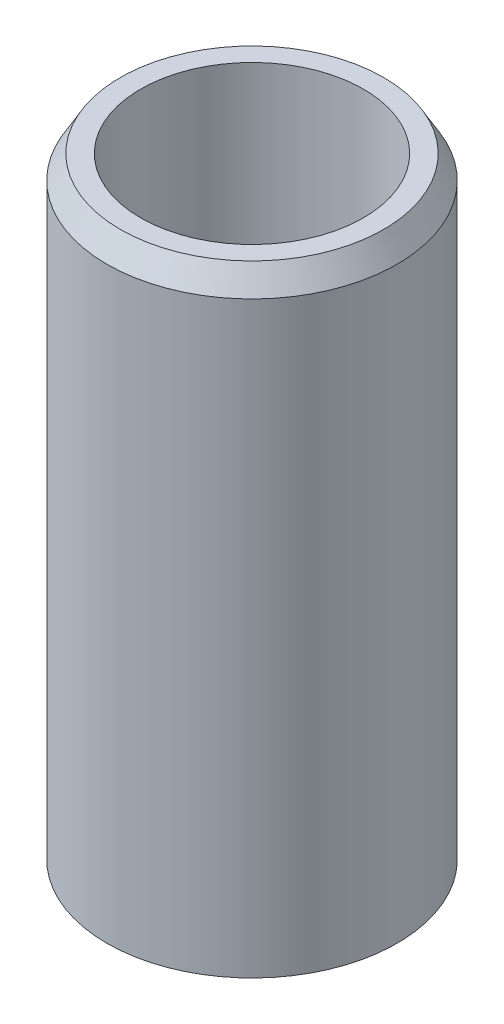
ISO-10303-21;
HEADER;
FILE_DESCRIPTION(('STEP AP214'),'2;1');
FILE_NAME('part.step','',(''),(''),'','','');
FILE_SCHEMA(('AUTOMOTIVE_DESIGN { 1 0 10303 214 1 1 1 1 }'));
ENDSEC;
DATA;
#1=APPLICATION_CONTEXT('core data for automotive mechanical design processes');
#2=APPLICATION_PROTOCOL_DEFINITION('international standard','automotive_design',2000,#1);
#3=PRODUCT_CONTEXT('',#1,'mechanical');
#4=PRODUCT('Part','Part','',(#3));
#5=PRODUCT_RELATED_PRODUCT_CATEGORY('part','',(#4));
#6=PRODUCT_DEFINITION_FORMATION('','',#4);
#7=PRODUCT_DEFINITION_CONTEXT('part definition',#1,'design');
#8=PRODUCT_DEFINITION('design','',#6,#7);
#9=PRODUCT_DEFINITION_SHAPE('','',#8);
#10=(LENGTH_UNIT() NAMED_UNIT(*) SI_UNIT(.MILLI.,.METRE.));
#11=(NAMED_UNIT(*) PLANE_ANGLE_UNIT() SI_UNIT($,.RADIAN.));
#12=(NAMED_UNIT(*) SI_UNIT($,.STERADIAN.) SOLID_ANGLE_UNIT());
#13=UNCERTAINTY_MEASURE_WITH_UNIT(LENGTH_MEASURE(1.E-05),#10,'distance_accuracy_value','');
#14=(GEOMETRIC_REPRESENTATION_CONTEXT(3) GLOBAL_UNCERTAINTY_ASSIGNED_CONTEXT((#13)) GLOBAL_UNIT_ASSIGNED_CONTEXT((#10,
#11,#12)) REPRESENTATION_CONTEXT('',''));
#15=CARTESIAN_POINT('',(0.,0.,0.));
#16=DIRECTION('',(0.,0.,1.));
#17=DIRECTION('',(1.,0.,0.));
#18=AXIS2_PLACEMENT_3D('',#15,#16,#17);
#19=CARTESIAN_POINT('',(0.,139.920728445781,0.));
#20=DIRECTION('',(0.,-1.,0.));
#21=DIRECTION('',(0.,0.,-1.));
#22=AXIS2_PLACEMENT_3D('',#19,#20,#21);
#23=CYLINDRICAL_SURFACE('',#22,32.5);
#24=CARTESIAN_POINT('',(0.,134.689747877225,0.));
#25=DIRECTION('',(0.,1.,0.));
#26=DIRECTION('',(0.,0.,1.));
#27=AXIS2_PLACEMENT_3D('',#24,#25,#26);
#28=CIRCLE('',#27,32.5);
#29=CARTESIAN_POINT('',(0.,134.689747877225,32.5));
#30=VERTEX_POINT('',#29);
#31=EDGE_CURVE('E50',#30,#30,#28,.F.);
#32=ORIENTED_EDGE('',*,*,#31,.T.);
#33=EDGE_LOOP('',(#32));
#34=FACE_BOUND('',#33,.T.);
#35=CARTESIAN_POINT('',(0.,3.02010803938149,0.));
#36=DIRECTION('',(0.,1.,0.));
#37=DIRECTION('',(0.,0.,1.));
#38=AXIS2_PLACEMENT_3D('',#35,#36,#37);
#39=CIRCLE('',#38,32.5);
#40=CARTESIAN_POINT('',(0.,3.02010803938149,32.5));
#41=VERTEX_POINT('',#40);
#42=EDGE_CURVE('E51',#41,#41,#39,.T.);
#43=ORIENTED_EDGE('',*,*,#42,.T.);
#44=EDGE_LOOP('',(#43));
#45=FACE_BOUND('',#44,.T.);
#46=ADVANCED_FACE('F39',(#34,#45),#23,.T.);
#47=CARTESIAN_POINT('',(0.,139.920728445781,0.));
#48=DIRECTION('',(0.,1.,0.));
#49=DIRECTION('',(0.,0.,1.));
#50=AXIS2_PLACEMENT_3D('',#47,#48,#49);
#51=PLANE('',#50);
#52=CARTESIAN_POINT('',(0.,139.920728445781,0.));
#53=DIRECTION('',(0.,1.,0.));
#54=DIRECTION('',(0.,0.,1.));
#55=AXIS2_PLACEMENT_3D('',#52,#53,#54);
#56=CIRCLE('',#55,29.4798919606185);
#57=CARTESIAN_POINT('',(0.,139.920728445781,29.4798919606185));
#58=VERTEX_POINT('',#57);
#59=EDGE_CURVE('E54',#58,#58,#56,.T.);
#60=ORIENTED_EDGE('',*,*,#59,.T.);
#61=EDGE_LOOP('',(#60));
#62=FACE_BOUND('',#61,.T.);
#63=CARTESIAN_POINT('',(0.,139.920728445781,0.));
#64=DIRECTION('',(0.,1.,0.));
#65=DIRECTION('',(0.,0.,1.));
#66=AXIS2_PLACEMENT_3D('',#63,#64,#65);
#67=CIRCLE('',#66,24.9663656061471);
#68=CARTESIAN_POINT('',(0.,139.920728445781,24.9663656061471));
#69=VERTEX_POINT('',#68);
#70=EDGE_CURVE('E58',#69,#69,#67,.T.);
#71=ORIENTED_EDGE('',*,*,#70,.F.);
#72=EDGE_LOOP('',(#71));
#73=FACE_BOUND('',#72,.T.);
#74=ADVANCED_FACE('F69',(#62,#73),#51,.T.);
#75=CARTESIAN_POINT('',(0.,0.,0.));
#76=DIRECTION('',(0.,1.,0.));
#77=DIRECTION('',(0.,0.,1.));
#78=AXIS2_PLACEMENT_3D('',#75,#76,#77);
#79=PLANE('',#78);
#80=CARTESIAN_POINT('',(0.,0.,0.));
#81=DIRECTION('',(0.,1.,0.));
#82=DIRECTION('',(0.,0.,1.));
#83=AXIS2_PLACEMENT_3D('',#80,#81,#82);
#84=CIRCLE('',#83,27.269019431444);
#85=CARTESIAN_POINT('',(0.,0.,27.269019431444));
#86=VERTEX_POINT('',#85);
#87=EDGE_CURVE('E10',#86,#86,#84,.F.);
#88=ORIENTED_EDGE('',*,*,#87,.T.);
#89=EDGE_LOOP('',(#88));
#90=FACE_BOUND('',#89,.T.);
#91=CARTESIAN_POINT('',(0.,0.,0.));
#92=DIRECTION('',(0.,1.,0.));
#93=DIRECTION('',(0.,0.,1.));
#94=AXIS2_PLACEMENT_3D('',#91,#92,#93);
#95=CIRCLE('',#94,24.9663656061471);
#96=CARTESIAN_POINT('',(0.,0.,24.9663656061471));
#97=VERTEX_POINT('',#96);
#98=EDGE_CURVE('E63',#97,#97,#95,.T.);
#99=ORIENTED_EDGE('',*,*,#98,.T.);
#100=EDGE_LOOP('',(#99));
#101=FACE_BOUND('',#100,.T.);
#102=ADVANCED_FACE('F75',(#90,#101),#79,.F.);
#103=CARTESIAN_POINT('',(0.,139.920728445781,0.));
#104=DIRECTION('',(0.,-1.,0.));
#105=DIRECTION('',(0.,0.,-1.));
#106=AXIS2_PLACEMENT_3D('',#103,#104,#105);
#107=CYLINDRICAL_SURFACE('',#106,24.9663656061471);
#108=ORIENTED_EDGE('',*,*,#70,.T.);
#109=EDGE_LOOP('',(#108));
#110=FACE_BOUND('',#109,.T.);
#111=ORIENTED_EDGE('',*,*,#98,.F.);
#112=EDGE_LOOP('',(#111));
#113=FACE_BOUND('',#112,.T.);
#114=ADVANCED_FACE('F70',(#110,#113),#107,.F.);
#115=CARTESIAN_POINT('',(0.,139.920728445781,0.));
#116=DIRECTION('',(0.,-1.,0.));
#117=DIRECTION('',(0.,0.,-1.));
#118=AXIS2_PLACEMENT_3D('',#115,#116,#117);
#119=CONICAL_SURFACE('',#118,29.4798919606185,0.523598775598293);
#120=ORIENTED_EDGE('',*,*,#31,.F.);
#121=EDGE_LOOP('',(#120));
#122=FACE_BOUND('',#121,.T.);
#123=ORIENTED_EDGE('',*,*,#59,.F.);
#124=EDGE_LOOP('',(#123));
#125=FACE_BOUND('',#124,.T.);
#126=ADVANCED_FACE('F81',(#122,#125),#119,.T.);
#127=CARTESIAN_POINT('',(0.,3.02010803938149,0.));
#128=DIRECTION('',(0.,1.,0.));
#129=DIRECTION('',(0.,0.,1.));
#130=AXIS2_PLACEMENT_3D('',#127,#128,#129);
#131=CONICAL_SURFACE('',#130,32.5,1.0471975511966);
#132=ORIENTED_EDGE('',*,*,#87,.F.);
#133=EDGE_LOOP('',(#132));
#134=FACE_BOUND('',#133,.T.);
#135=ORIENTED_EDGE('',*,*,#42,.F.);
#136=EDGE_LOOP('',(#135));
#137=FACE_BOUND('',#136,.T.);
#138=ADVANCED_FACE('F45',(#134,#137),#131,.T.);
#139=CLOSED_SHELL('',(#46,#74,#102,#114,#126,#138));
#140=MANIFOLD_SOLID_BREP('B2',#139);
#141=ADVANCED_BREP_SHAPE_REPRESENTATION('',(#18,#140),#14);
#142=SHAPE_DEFINITION_REPRESENTATION(#9,#141);
ENDSEC;
END-ISO-10303-21;
